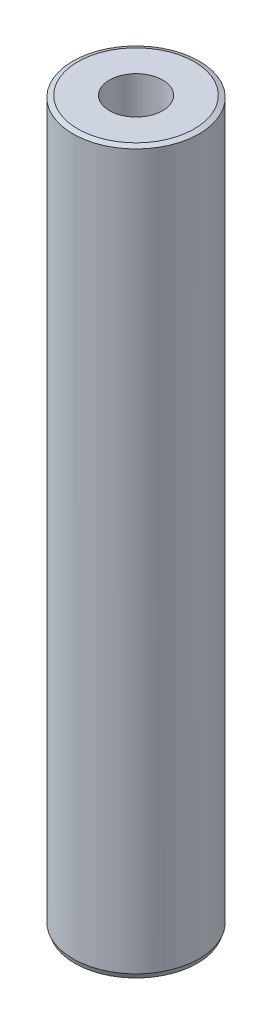
ISO-10303-21;
HEADER;
FILE_DESCRIPTION(('STEP AP214'),'2;1');
FILE_NAME('part.step','',(''),(''),'','','');
FILE_SCHEMA(('AUTOMOTIVE_DESIGN { 1 0 10303 214 1 1 1 1 }'));
ENDSEC;
DATA;
#1=APPLICATION_CONTEXT('core data for automotive mechanical design processes');
#2=APPLICATION_PROTOCOL_DEFINITION('international standard','automotive_design',2000,#1);
#3=PRODUCT_CONTEXT('',#1,'mechanical');
#4=PRODUCT('Part','Part','',(#3));
#5=PRODUCT_RELATED_PRODUCT_CATEGORY('part','',(#4));
#6=PRODUCT_DEFINITION_FORMATION('','',#4);
#7=PRODUCT_DEFINITION_CONTEXT('part definition',#1,'design');
#8=PRODUCT_DEFINITION('design','',#6,#7);
#9=PRODUCT_DEFINITION_SHAPE('','',#8);
#10=(LENGTH_UNIT() NAMED_UNIT(*) SI_UNIT(.MILLI.,.METRE.));
#11=(NAMED_UNIT(*) PLANE_ANGLE_UNIT() SI_UNIT($,.RADIAN.));
#12=(NAMED_UNIT(*) SI_UNIT($,.STERADIAN.) SOLID_ANGLE_UNIT());
#13=UNCERTAINTY_MEASURE_WITH_UNIT(LENGTH_MEASURE(1.E-05),#10,'distance_accuracy_value','');
#14=(GEOMETRIC_REPRESENTATION_CONTEXT(3) GLOBAL_UNCERTAINTY_ASSIGNED_CONTEXT((#13)) GLOBAL_UNIT_ASSIGNED_CONTEXT((#10,
#11,#12)) REPRESENTATION_CONTEXT('',''));
#15=CARTESIAN_POINT('',(0.,0.,0.));
#16=DIRECTION('',(0.,0.,1.));
#17=DIRECTION('',(1.,0.,0.));
#18=AXIS2_PLACEMENT_3D('',#15,#16,#17);
#19=CARTESIAN_POINT('',(0.,600.,0.));
#20=DIRECTION('',(0.,-1.,0.));
#21=DIRECTION('',(0.,0.,-1.));
#22=AXIS2_PLACEMENT_3D('',#19,#20,#21);
#23=CYLINDRICAL_SURFACE('',#22,52.5);
#24=CARTESIAN_POINT('',(0.,598.467372839881,0.));
#25=DIRECTION('',(0.,1.,0.));
#26=DIRECTION('',(0.,0.,1.));
#27=AXIS2_PLACEMENT_3D('',#24,#25,#26);
#28=CIRCLE('',#27,52.5);
#29=CARTESIAN_POINT('',(0.,598.467372839881,-52.5000000000001));
#30=VERTEX_POINT('',#29);
#31=EDGE_CURVE('E50',#30,#30,#28,.F.);
#32=ORIENTED_EDGE('',*,*,#31,.T.);
#33=EDGE_LOOP('',(#32));
#34=FACE_BOUND('',#33,.T.);
#35=CARTESIAN_POINT('',(0.,4.06396838504042,0.));
#36=DIRECTION('',(0.,1.,0.));
#37=DIRECTION('',(0.,0.,1.));
#38=AXIS2_PLACEMENT_3D('',#35,#36,#37);
#39=CIRCLE('',#38,52.5);
#40=CARTESIAN_POINT('',(0.,4.06396838504042,52.5));
#41=VERTEX_POINT('',#40);
#42=EDGE_CURVE('E51',#41,#41,#39,.T.);
#43=ORIENTED_EDGE('',*,*,#42,.T.);
#44=EDGE_LOOP('',(#43));
#45=FACE_BOUND('',#44,.T.);
#46=ADVANCED_FACE('F39',(#34,#45),#23,.T.);
#47=CARTESIAN_POINT('',(0.,600.,0.));
#48=DIRECTION('',(0.,1.,0.));
#49=DIRECTION('',(0.,0.,1.));
#50=AXIS2_PLACEMENT_3D('',#47,#48,#49);
#51=PLANE('',#50);
#52=CARTESIAN_POINT('',(0.,600.,0.));
#53=DIRECTION('',(0.,1.,0.));
#54=DIRECTION('',(0.,0.,1.));
#55=AXIS2_PLACEMENT_3D('',#52,#53,#54);
#56=CIRCLE('',#55,48.4360316149602);
#57=CARTESIAN_POINT('',(0.,600.,-48.4360316149604));
#58=VERTEX_POINT('',#57);
#59=EDGE_CURVE('E54',#58,#58,#56,.T.);
#60=ORIENTED_EDGE('',*,*,#59,.T.);
#61=EDGE_LOOP('',(#60));
#62=FACE_BOUND('',#61,.T.);
#63=CARTESIAN_POINT('',(0.,600.,0.));
#64=DIRECTION('',(0.,1.,0.));
#65=DIRECTION('',(0.,0.,1.));
#66=AXIS2_PLACEMENT_3D('',#63,#64,#65);
#67=CIRCLE('',#66,22.1295999892334);
#68=CARTESIAN_POINT('',(0.,600.,22.1295999892334));
#69=VERTEX_POINT('',#68);
#70=EDGE_CURVE('E58',#69,#69,#67,.T.);
#71=ORIENTED_EDGE('',*,*,#70,.F.);
#72=EDGE_LOOP('',(#71));
#73=FACE_BOUND('',#72,.T.);
#74=ADVANCED_FACE('F69',(#62,#73),#51,.T.);
#75=CARTESIAN_POINT('',(0.,0.,0.));
#76=DIRECTION('',(0.,1.,0.));
#77=DIRECTION('',(0.,0.,1.));
#78=AXIS2_PLACEMENT_3D('',#75,#76,#77);
#79=PLANE('',#78);
#80=CARTESIAN_POINT('',(0.,0.,0.));
#81=DIRECTION('',(0.,1.,0.));
#82=DIRECTION('',(0.,0.,1.));
#83=AXIS2_PLACEMENT_3D('',#80,#81,#82);
#84=CIRCLE('',#83,50.9673728398813);
#85=CARTESIAN_POINT('',(0.,0.,50.9673728398813));
#86=VERTEX_POINT('',#85);
#87=EDGE_CURVE('E10',#86,#86,#84,.F.);
#88=ORIENTED_EDGE('',*,*,#87,.T.);
#89=EDGE_LOOP('',(#88));
#90=FACE_BOUND('',#89,.T.);
#91=CARTESIAN_POINT('',(0.,0.,0.));
#92=DIRECTION('',(0.,1.,0.));
#93=DIRECTION('',(0.,0.,1.));
#94=AXIS2_PLACEMENT_3D('',#91,#92,#93);
#95=CIRCLE('',#94,22.1295999892334);
#96=CARTESIAN_POINT('',(0.,0.,22.1295999892334));
#97=VERTEX_POINT('',#96);
#98=EDGE_CURVE('E63',#97,#97,#95,.T.);
#99=ORIENTED_EDGE('',*,*,#98,.T.);
#100=EDGE_LOOP('',(#99));
#101=FACE_BOUND('',#100,.T.);
#102=ADVANCED_FACE('F75',(#90,#101),#79,.F.);
#103=CARTESIAN_POINT('',(0.,600.,0.));
#104=DIRECTION('',(0.,-1.,0.));
#105=DIRECTION('',(0.,0.,-1.));
#106=AXIS2_PLACEMENT_3D('',#103,#104,#105);
#107=CYLINDRICAL_SURFACE('',#106,22.1295999892334);
#108=ORIENTED_EDGE('',*,*,#70,.T.);
#109=EDGE_LOOP('',(#108));
#110=FACE_BOUND('',#109,.T.);
#111=ORIENTED_EDGE('',*,*,#98,.F.);
#112=EDGE_LOOP('',(#111));
#113=FACE_BOUND('',#112,.T.);
#114=ADVANCED_FACE('F70',(#110,#113),#107,.F.);
#115=CARTESIAN_POINT('',(0.,600.,0.));
#116=DIRECTION('',(0.,-1.,0.));
#117=DIRECTION('',(0.,0.,-1.));
#118=AXIS2_PLACEMENT_3D('',#115,#116,#117);
#119=CONICAL_SURFACE('',#118,48.4360316149602,1.21016328148568);
#120=CARTESIAN_POINT('',(0.,598.467372839881,-52.5000000000001));
#121=CARTESIAN_POINT('',(0.,598.483337706133,-52.4576669959893));
#122=CARTESIAN_POINT('',(0.,598.499302572384,-52.4153339919785));
#123=CARTESIAN_POINT('',(0.,598.531232304886,-52.3306679839568));
#124=CARTESIAN_POINT('',(0.,598.547197171138,-52.288334979946));
#125=CARTESIAN_POINT('',(0.,598.57912690364,-52.2036689719243));
#126=CARTESIAN_POINT('',(0.,598.595091769891,-52.1613359679135));
#127=CARTESIAN_POINT('',(0.,598.627021502394,-52.0766699598918));
#128=CARTESIAN_POINT('',(0.,598.642986368645,-52.034336955881));
#129=CARTESIAN_POINT('',(0.,598.674916101147,-51.9496709478593));
#130=CARTESIAN_POINT('',(0.,598.690880967399,-51.9073379438485));
#131=CARTESIAN_POINT('',(0.,598.722810699901,-51.8226719358269));
#132=CARTESIAN_POINT('',(0.,598.738775566152,-51.780338931816));
#133=CARTESIAN_POINT('',(0.,598.770705298655,-51.6956729237944));
#134=CARTESIAN_POINT('',(0.,598.786670164906,-51.6533399197835));
#135=CARTESIAN_POINT('',(0.,598.818599897409,-51.5686739117619));
#136=CARTESIAN_POINT('',(0.,598.83456476366,-51.526340907751));
#137=CARTESIAN_POINT('',(0.,598.866494496162,-51.4416748997294));
#138=CARTESIAN_POINT('',(0.,598.882459362414,-51.3993418957186));
#139=CARTESIAN_POINT('',(0.,598.914389094916,-51.3146758876969));
#140=CARTESIAN_POINT('',(0.,598.930353961167,-51.272342883686));
#141=CARTESIAN_POINT('',(0.,598.96228369367,-51.1876768756644));
#142=CARTESIAN_POINT('',(0.,598.978248559921,-51.1453438716536));
#143=CARTESIAN_POINT('',(0.,599.010178292423,-51.0606778636319));
#144=CARTESIAN_POINT('',(0.,599.026143158675,-51.0183448596211));
#145=CARTESIAN_POINT('',(0.,599.058072891177,-50.9336788515994));
#146=CARTESIAN_POINT('',(0.,599.074037757428,-50.8913458475886));
#147=CARTESIAN_POINT('',(0.,599.105967489931,-50.8066798395669));
#148=CARTESIAN_POINT('',(0.,599.121932356182,-50.7643468355561));
#149=CARTESIAN_POINT('',(0.,599.153862088684,-50.6796808275344));
#150=CARTESIAN_POINT('',(0.,599.169826954936,-50.6373478235236));
#151=CARTESIAN_POINT('',(0.,599.201756687438,-50.5526818155019));
#152=CARTESIAN_POINT('',(0.,599.217721553689,-50.5103488114911));
#153=CARTESIAN_POINT('',(0.,599.249651286192,-50.4256828034694));
#154=CARTESIAN_POINT('',(0.,599.265616152443,-50.3833497994586));
#155=CARTESIAN_POINT('',(0.,599.297545884946,-50.2986837914369));
#156=CARTESIAN_POINT('',(0.,599.313510751197,-50.2563507874261));
#157=CARTESIAN_POINT('',(0.,599.345440483699,-50.1716847794045));
#158=CARTESIAN_POINT('',(0.,599.36140534995,-50.1293517753936));
#159=CARTESIAN_POINT('',(0.,599.393335082453,-50.044685767372));
#160=CARTESIAN_POINT('',(0.,599.409299948704,-50.0023527633611));
#161=CARTESIAN_POINT('',(0.,599.441229681207,-49.9176867553395));
#162=CARTESIAN_POINT('',(0.,599.457194547458,-49.8753537513286));
#163=CARTESIAN_POINT('',(0.,599.48912427996,-49.790687743307));
#164=CARTESIAN_POINT('',(0.,599.505089146212,-49.7483547392962));
#165=CARTESIAN_POINT('',(0.,599.537018878714,-49.6636887312745));
#166=CARTESIAN_POINT('',(0.,599.552983744965,-49.6213557272636));
#167=CARTESIAN_POINT('',(0.,599.584913477468,-49.536689719242));
#168=CARTESIAN_POINT('',(0.,599.600878343719,-49.4943567152312));
#169=CARTESIAN_POINT('',(0.,599.632808076222,-49.4096907072095));
#170=CARTESIAN_POINT('',(0.,599.648772942473,-49.3673577031987));
#171=CARTESIAN_POINT('',(0.,599.680702674975,-49.282691695177));
#172=CARTESIAN_POINT('',(0.,599.696667541226,-49.2403586911662));
#173=CARTESIAN_POINT('',(0.,599.728597273729,-49.1556926831445));
#174=CARTESIAN_POINT('',(0.,599.74456213998,-49.1133596791337));
#175=CARTESIAN_POINT('',(0.,599.776491872483,-49.028693671112));
#176=CARTESIAN_POINT('',(0.,599.792456738734,-48.9863606671012));
#177=CARTESIAN_POINT('',(0.,599.824386471236,-48.9016946590795));
#178=CARTESIAN_POINT('',(0.,599.840351337488,-48.8593616550687));
#179=CARTESIAN_POINT('',(0.,599.87228106999,-48.774695647047));
#180=CARTESIAN_POINT('',(0.,599.888245936241,-48.7323626430362));
#181=CARTESIAN_POINT('',(0.,599.920175668744,-48.6476966350145));
#182=CARTESIAN_POINT('',(0.,599.936140534995,-48.6053636310037));
#183=CARTESIAN_POINT('',(0.,599.968070267497,-48.520697622982));
#184=CARTESIAN_POINT('',(0.,599.984035133749,-48.4783646189712));
#185=CARTESIAN_POINT('',(0.,600.,-48.4360316149604));
#186=B_SPLINE_CURVE_WITH_KNOTS('',3,(#120,#121,#122,#123,#124,#125,#126,#127,#128,#129,#130,
#131,#132,#133,#134,#135,#136,#137,#138,#139,#140,#141,#142,#143,#144,#145,#146,#147,#148,#149,
#150,#151,#152,#153,#154,#155,#156,#157,#158,#159,#160,#161,#162,#163,#164,#165,#166,#167,#168,
#169,#170,#171,#172,#173,#174,#175,#176,#177,#178,#179,#180,#181,#182,#183,#184,#185),
.UNSPECIFIED.,.F.,.F.,(4,2,2,2,2,2,2,2,2,2,2,2,2,2,2,2,2,2,2,2,2,2,2,2,2,2,2,2,2,2,2,2,4),(0.,
0.135730032222099,0.271460064444165,0.407190096666264,0.542920128888331,0.67865016111043,
0.814380193332496,0.950110225554595,1.08584025777666,1.22157028999876,1.35730032222083,
1.49303035444293,1.62876038666499,1.7644904188871,1.90022045110916,2.03595048333126,
2.17168051555332,2.30741054777539,2.44314057999749,2.57887061221955,2.71460064444165,
2.85033067666372,2.98606070888582,3.12179074110789,3.25752077332999,3.39325080555205,
3.52898083777416,3.66471086999622,3.80044090221832,3.93617093444038,4.07190096666249,
4.20763099888455,4.34336103110665),.UNSPECIFIED.);
#187=EDGE_CURVE('BSEAM81',#30,#58,#186,.T.);
#188=ORIENTED_EDGE('',*,*,#31,.F.);
#189=ORIENTED_EDGE('',*,*,#59,.F.);
#190=ORIENTED_EDGE('',*,*,#187,.T.);
#191=ORIENTED_EDGE('',*,*,#187,.F.);
#192=EDGE_LOOP('',(#188,#190,#189,#191));
#193=FACE_BOUND('',#192,.T.);
#194=ADVANCED_FACE('F81',(#193),#119,.T.);
#195=CARTESIAN_POINT('',(0.,4.06396838504042,0.));
#196=DIRECTION('',(0.,1.,0.));
#197=DIRECTION('',(0.,0.,1.));
#198=AXIS2_PLACEMENT_3D('',#195,#196,#197);
#199=CONICAL_SURFACE('',#198,52.5,0.360633045309201);
#200=ORIENTED_EDGE('',*,*,#87,.F.);
#201=EDGE_LOOP('',(#200));
#202=FACE_BOUND('',#201,.T.);
#203=ORIENTED_EDGE('',*,*,#42,.F.);
#204=EDGE_LOOP('',(#203));
#205=FACE_BOUND('',#204,.T.);
#206=ADVANCED_FACE('F45',(#202,#205),#199,.T.);
#207=CLOSED_SHELL('',(#46,#74,#102,#114,#194,#206));
#208=MANIFOLD_SOLID_BREP('B2',#207);
#209=ADVANCED_BREP_SHAPE_REPRESENTATION('',(#18,#208),#14);
#210=SHAPE_DEFINITION_REPRESENTATION(#9,#209);
ENDSEC;
END-ISO-10303-21;
